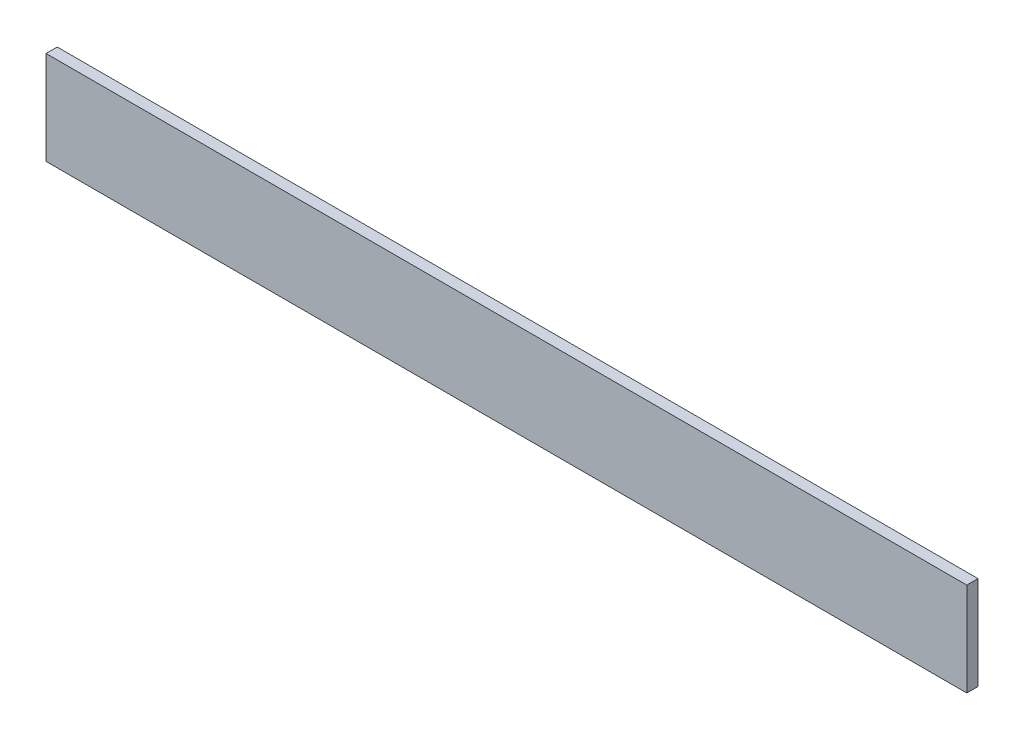
ISO-10303-21;
HEADER;
FILE_DESCRIPTION(('STEP AP214'),'2;1');
FILE_NAME('part.step','',(''),(''),'','','');
FILE_SCHEMA(('AUTOMOTIVE_DESIGN { 1 0 10303 214 1 1 1 1 }'));
ENDSEC;
DATA;
#1=APPLICATION_CONTEXT('core data for automotive mechanical design processes');
#2=APPLICATION_PROTOCOL_DEFINITION('international standard','automotive_design',2000,#1);
#3=PRODUCT_CONTEXT('',#1,'mechanical');
#4=PRODUCT('Part','Part','',(#3));
#5=PRODUCT_RELATED_PRODUCT_CATEGORY('part','',(#4));
#6=PRODUCT_DEFINITION_FORMATION('','',#4);
#7=PRODUCT_DEFINITION_CONTEXT('part definition',#1,'design');
#8=PRODUCT_DEFINITION('design','',#6,#7);
#9=PRODUCT_DEFINITION_SHAPE('','',#8);
#10=(LENGTH_UNIT() NAMED_UNIT(*) SI_UNIT(.MILLI.,.METRE.));
#11=(NAMED_UNIT(*) PLANE_ANGLE_UNIT() SI_UNIT($,.RADIAN.));
#12=(NAMED_UNIT(*) SI_UNIT($,.STERADIAN.) SOLID_ANGLE_UNIT());
#13=UNCERTAINTY_MEASURE_WITH_UNIT(LENGTH_MEASURE(1.E-05),#10,'distance_accuracy_value','');
#14=(GEOMETRIC_REPRESENTATION_CONTEXT(3) GLOBAL_UNCERTAINTY_ASSIGNED_CONTEXT((#13)) GLOBAL_UNIT_ASSIGNED_CONTEXT((#10,
#11,#12)) REPRESENTATION_CONTEXT('',''));
#15=CARTESIAN_POINT('',(0.,0.,0.));
#16=DIRECTION('',(0.,0.,1.));
#17=DIRECTION('',(1.,0.,0.));
#18=AXIS2_PLACEMENT_3D('',#15,#16,#17);
#19=CARTESIAN_POINT('',(985.,0.,12.));
#20=DIRECTION('',(0.,1.,0.));
#21=DIRECTION('',(0.,0.,1.));
#22=AXIS2_PLACEMENT_3D('',#19,#20,#21);
#23=PLANE('',#22);
#24=DIRECTION('',(1.,0.,0.));
#25=VECTOR('',#24,1.);
#26=CARTESIAN_POINT('',(985.,0.,0.));
#27=LINE('',#26,#25);
#28=CARTESIAN_POINT('',(0.,0.,0.));
#29=VERTEX_POINT('',#28);
#30=CARTESIAN_POINT('',(985.,0.,0.));
#31=VERTEX_POINT('',#30);
#32=EDGE_CURVE('E107',#29,#31,#27,.T.);
#33=ORIENTED_EDGE('',*,*,#32,.T.);
#34=DIRECTION('',(0.,0.,-1.));
#35=VECTOR('',#34,1.);
#36=CARTESIAN_POINT('',(985.,0.,12.));
#37=LINE('',#36,#35);
#38=CARTESIAN_POINT('',(985.,0.,12.));
#39=VERTEX_POINT('',#38);
#40=EDGE_CURVE('E11',#39,#31,#37,.T.);
#41=ORIENTED_EDGE('',*,*,#40,.F.);
#42=DIRECTION('',(1.,0.,0.));
#43=VECTOR('',#42,1.);
#44=CARTESIAN_POINT('',(985.,0.,12.));
#45=LINE('',#44,#43);
#46=CARTESIAN_POINT('',(0.,0.,12.));
#47=VERTEX_POINT('',#46);
#48=EDGE_CURVE('E91',#47,#39,#45,.T.);
#49=ORIENTED_EDGE('',*,*,#48,.F.);
#50=DIRECTION('',(0.,0.,-1.));
#51=VECTOR('',#50,1.);
#52=CARTESIAN_POINT('',(0.,0.,12.));
#53=LINE('',#52,#51);
#54=EDGE_CURVE('E103',#47,#29,#53,.T.);
#55=ORIENTED_EDGE('',*,*,#54,.T.);
#56=EDGE_LOOP('',(#33,#41,#49,#55));
#57=FACE_BOUND('',#56,.T.);
#58=ADVANCED_FACE('F39',(#57),#23,.F.);
#59=CARTESIAN_POINT('',(985.,100.,12.));
#60=DIRECTION('',(-1.,0.,0.));
#61=DIRECTION('',(0.,-1.,0.));
#62=AXIS2_PLACEMENT_3D('',#59,#60,#61);
#63=PLANE('',#62);
#64=DIRECTION('',(0.,1.,0.));
#65=VECTOR('',#64,1.);
#66=CARTESIAN_POINT('',(985.,100.,0.));
#67=LINE('',#66,#65);
#68=CARTESIAN_POINT('',(985.,100.,0.));
#69=VERTEX_POINT('',#68);
#70=EDGE_CURVE('E96',#31,#69,#67,.T.);
#71=ORIENTED_EDGE('',*,*,#70,.T.);
#72=DIRECTION('',(0.,0.,-1.));
#73=VECTOR('',#72,1.);
#74=CARTESIAN_POINT('',(985.,100.,12.));
#75=LINE('',#74,#73);
#76=CARTESIAN_POINT('',(985.,100.,12.));
#77=VERTEX_POINT('',#76);
#78=EDGE_CURVE('E48',#77,#69,#75,.T.);
#79=ORIENTED_EDGE('',*,*,#78,.F.);
#80=DIRECTION('',(0.,1.,0.));
#81=VECTOR('',#80,1.);
#82=CARTESIAN_POINT('',(985.,100.,12.));
#83=LINE('',#82,#81);
#84=EDGE_CURVE('E86',#39,#77,#83,.T.);
#85=ORIENTED_EDGE('',*,*,#84,.F.);
#86=ORIENTED_EDGE('',*,*,#40,.T.);
#87=EDGE_LOOP('',(#71,#79,#85,#86));
#88=FACE_BOUND('',#87,.T.);
#89=ADVANCED_FACE('F95',(#88),#63,.F.);
#90=CARTESIAN_POINT('',(0.,100.,12.));
#91=DIRECTION('',(0.,-1.,0.));
#92=DIRECTION('',(0.,0.,-1.));
#93=AXIS2_PLACEMENT_3D('',#90,#91,#92);
#94=PLANE('',#93);
#95=DIRECTION('',(-1.,0.,0.));
#96=VECTOR('',#95,1.);
#97=CARTESIAN_POINT('',(0.,100.,0.));
#98=LINE('',#97,#96);
#99=CARTESIAN_POINT('',(0.,100.,0.));
#100=VERTEX_POINT('',#99);
#101=EDGE_CURVE('E73',#69,#100,#98,.T.);
#102=ORIENTED_EDGE('',*,*,#101,.T.);
#103=DIRECTION('',(0.,0.,-1.));
#104=VECTOR('',#103,1.);
#105=CARTESIAN_POINT('',(0.,100.,12.));
#106=LINE('',#105,#104);
#107=CARTESIAN_POINT('',(0.,100.,12.));
#108=VERTEX_POINT('',#107);
#109=EDGE_CURVE('E98',#108,#100,#106,.T.);
#110=ORIENTED_EDGE('',*,*,#109,.F.);
#111=DIRECTION('',(-1.,0.,0.));
#112=VECTOR('',#111,1.);
#113=CARTESIAN_POINT('',(0.,100.,12.));
#114=LINE('',#113,#112);
#115=EDGE_CURVE('E89',#77,#108,#114,.T.);
#116=ORIENTED_EDGE('',*,*,#115,.F.);
#117=ORIENTED_EDGE('',*,*,#78,.T.);
#118=EDGE_LOOP('',(#102,#110,#116,#117));
#119=FACE_BOUND('',#118,.T.);
#120=ADVANCED_FACE('F99',(#119),#94,.F.);
#121=CARTESIAN_POINT('',(0.,0.,12.));
#122=DIRECTION('',(1.,0.,0.));
#123=DIRECTION('',(0.,0.,-1.));
#124=AXIS2_PLACEMENT_3D('',#121,#122,#123);
#125=PLANE('',#124);
#126=DIRECTION('',(0.,-1.,0.));
#127=VECTOR('',#126,1.);
#128=CARTESIAN_POINT('',(0.,0.,0.));
#129=LINE('',#128,#127);
#130=EDGE_CURVE('E79',#100,#29,#129,.T.);
#131=ORIENTED_EDGE('',*,*,#130,.T.);
#132=ORIENTED_EDGE('',*,*,#54,.F.);
#133=DIRECTION('',(0.,-1.,0.));
#134=VECTOR('',#133,1.);
#135=CARTESIAN_POINT('',(0.,0.,12.));
#136=LINE('',#135,#134);
#137=EDGE_CURVE('E56',#108,#47,#136,.T.);
#138=ORIENTED_EDGE('',*,*,#137,.F.);
#139=ORIENTED_EDGE('',*,*,#109,.T.);
#140=EDGE_LOOP('',(#131,#132,#138,#139));
#141=FACE_BOUND('',#140,.T.);
#142=ADVANCED_FACE('F120',(#141),#125,.F.);
#143=CARTESIAN_POINT('',(0.,0.,12.));
#144=DIRECTION('',(0.,0.,-1.));
#145=DIRECTION('',(-1.,0.,0.));
#146=AXIS2_PLACEMENT_3D('',#143,#144,#145);
#147=PLANE('',#146);
#148=ORIENTED_EDGE('',*,*,#48,.T.);
#149=ORIENTED_EDGE('',*,*,#84,.T.);
#150=ORIENTED_EDGE('',*,*,#115,.T.);
#151=ORIENTED_EDGE('',*,*,#137,.T.);
#152=EDGE_LOOP('',(#148,#149,#150,#151));
#153=FACE_BOUND('',#152,.T.);
#154=ADVANCED_FACE('F87',(#153),#147,.F.);
#155=CARTESIAN_POINT('',(0.,0.,0.));
#156=DIRECTION('',(0.,0.,-1.));
#157=DIRECTION('',(-1.,0.,0.));
#158=AXIS2_PLACEMENT_3D('',#155,#156,#157);
#159=PLANE('',#158);
#160=ORIENTED_EDGE('',*,*,#32,.F.);
#161=ORIENTED_EDGE('',*,*,#130,.F.);
#162=ORIENTED_EDGE('',*,*,#101,.F.);
#163=ORIENTED_EDGE('',*,*,#70,.F.);
#164=EDGE_LOOP('',(#160,#161,#162,#163));
#165=FACE_BOUND('',#164,.T.);
#166=ADVANCED_FACE('F123',(#165),#159,.T.);
#167=CLOSED_SHELL('',(#58,#89,#120,#142,#154,#166));
#168=MANIFOLD_SOLID_BREP('B2',#167);
#169=ADVANCED_BREP_SHAPE_REPRESENTATION('',(#18,#168),#14);
#170=SHAPE_DEFINITION_REPRESENTATION(#9,#169);
ENDSEC;
END-ISO-10303-21;
